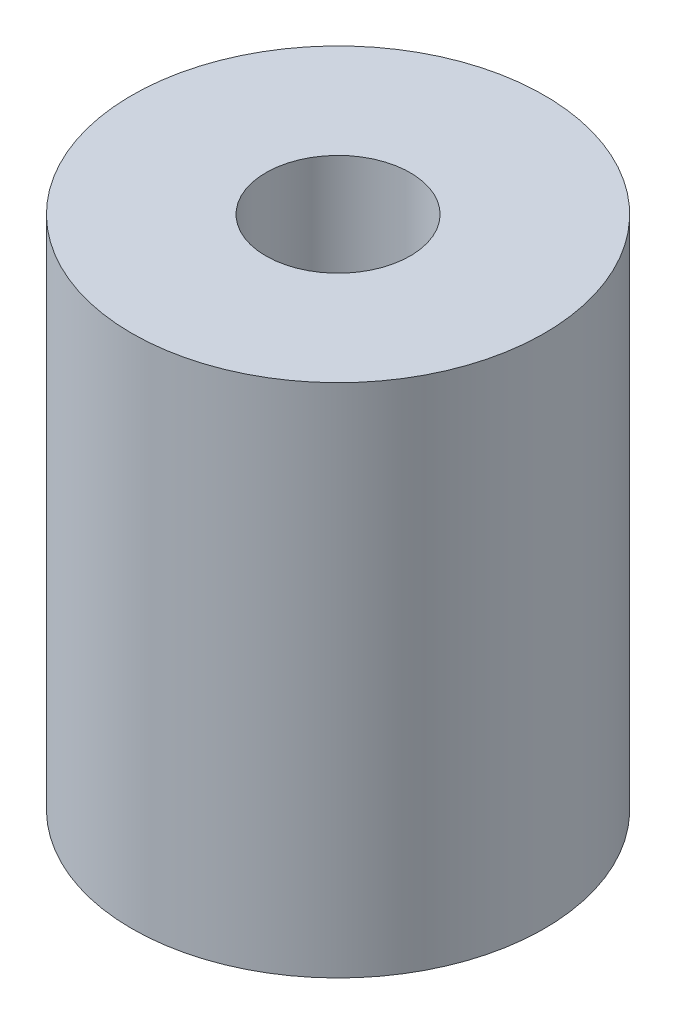
ISO-10303-21;
HEADER;
FILE_DESCRIPTION(('STEP AP214'),'2;1');
FILE_NAME('part.step','',(''),(''),'','','');
FILE_SCHEMA(('AUTOMOTIVE_DESIGN { 1 0 10303 214 1 1 1 1 }'));
ENDSEC;
DATA;
#1=APPLICATION_CONTEXT('core data for automotive mechanical design processes');
#2=APPLICATION_PROTOCOL_DEFINITION('international standard','automotive_design',2000,#1);
#3=PRODUCT_CONTEXT('',#1,'mechanical');
#4=PRODUCT('Part','Part','',(#3));
#5=PRODUCT_RELATED_PRODUCT_CATEGORY('part','',(#4));
#6=PRODUCT_DEFINITION_FORMATION('','',#4);
#7=PRODUCT_DEFINITION_CONTEXT('part definition',#1,'design');
#8=PRODUCT_DEFINITION('design','',#6,#7);
#9=PRODUCT_DEFINITION_SHAPE('','',#8);
#10=(LENGTH_UNIT() NAMED_UNIT(*) SI_UNIT(.MILLI.,.METRE.));
#11=(NAMED_UNIT(*) PLANE_ANGLE_UNIT() SI_UNIT($,.RADIAN.));
#12=(NAMED_UNIT(*) SI_UNIT($,.STERADIAN.) SOLID_ANGLE_UNIT());
#13=UNCERTAINTY_MEASURE_WITH_UNIT(LENGTH_MEASURE(1.E-05),#10,'distance_accuracy_value','');
#14=(GEOMETRIC_REPRESENTATION_CONTEXT(3) GLOBAL_UNCERTAINTY_ASSIGNED_CONTEXT((#13)) GLOBAL_UNIT_ASSIGNED_CONTEXT((#10,
#11,#12)) REPRESENTATION_CONTEXT('',''));
#15=CARTESIAN_POINT('',(0.,0.,0.));
#16=DIRECTION('',(0.,0.,1.));
#17=DIRECTION('',(1.,0.,0.));
#18=AXIS2_PLACEMENT_3D('',#15,#16,#17);
#19=CARTESIAN_POINT('',(0.,12.7,0.));
#20=DIRECTION('',(0.,1.,0.));
#21=DIRECTION('',(0.,0.,1.));
#22=AXIS2_PLACEMENT_3D('',#19,#20,#21);
#23=PLANE('',#22);
#24=CARTESIAN_POINT('',(0.,12.7,0.));
#25=DIRECTION('',(0.,1.,0.));
#26=DIRECTION('',(0.,0.,1.));
#27=AXIS2_PLACEMENT_3D('',#24,#25,#26);
#28=CIRCLE('',#27,5.08);
#29=CARTESIAN_POINT('',(0.,12.7,5.08));
#30=VERTEX_POINT('',#29);
#31=EDGE_CURVE('E11',#30,#30,#28,.T.);
#32=ORIENTED_EDGE('',*,*,#31,.T.);
#33=EDGE_LOOP('',(#32));
#34=FACE_BOUND('',#33,.T.);
#35=CARTESIAN_POINT('',(0.,12.7,0.));
#36=DIRECTION('',(0.,1.,0.));
#37=DIRECTION('',(0.,0.,1.));
#38=AXIS2_PLACEMENT_3D('',#35,#36,#37);
#39=CIRCLE('',#38,1.778);
#40=CARTESIAN_POINT('',(0.,12.7,1.778));
#41=VERTEX_POINT('',#40);
#42=EDGE_CURVE('E58',#41,#41,#39,.T.);
#43=ORIENTED_EDGE('',*,*,#42,.F.);
#44=EDGE_LOOP('',(#43));
#45=FACE_BOUND('',#44,.T.);
#46=ADVANCED_FACE('F47',(#34,#45),#23,.T.);
#47=CARTESIAN_POINT('',(0.,0.,0.));
#48=DIRECTION('',(0.,1.,0.));
#49=DIRECTION('',(0.,0.,1.));
#50=AXIS2_PLACEMENT_3D('',#47,#48,#49);
#51=PLANE('',#50);
#52=CARTESIAN_POINT('',(0.,0.,0.));
#53=DIRECTION('',(0.,1.,0.));
#54=DIRECTION('',(0.,0.,1.));
#55=AXIS2_PLACEMENT_3D('',#52,#53,#54);
#56=CIRCLE('',#55,5.08);
#57=CARTESIAN_POINT('',(0.,0.,5.08));
#58=VERTEX_POINT('',#57);
#59=EDGE_CURVE('E51',#58,#58,#56,.T.);
#60=ORIENTED_EDGE('',*,*,#59,.F.);
#61=EDGE_LOOP('',(#60));
#62=FACE_BOUND('',#61,.T.);
#63=CARTESIAN_POINT('',(0.,0.,0.));
#64=DIRECTION('',(0.,1.,0.));
#65=DIRECTION('',(0.,0.,1.));
#66=AXIS2_PLACEMENT_3D('',#63,#64,#65);
#67=CIRCLE('',#66,1.778);
#68=CARTESIAN_POINT('',(0.,0.,1.778));
#69=VERTEX_POINT('',#68);
#70=EDGE_CURVE('E60',#69,#69,#67,.T.);
#71=ORIENTED_EDGE('',*,*,#70,.T.);
#72=EDGE_LOOP('',(#71));
#73=FACE_BOUND('',#72,.T.);
#74=ADVANCED_FACE('F70',(#62,#73),#51,.F.);
#75=CARTESIAN_POINT('',(0.,12.7,0.));
#76=DIRECTION('',(0.,-1.,0.));
#77=DIRECTION('',(0.,0.,-1.));
#78=AXIS2_PLACEMENT_3D('',#75,#76,#77);
#79=CYLINDRICAL_SURFACE('',#78,5.08);
#80=ORIENTED_EDGE('',*,*,#31,.F.);
#81=EDGE_LOOP('',(#80));
#82=FACE_BOUND('',#81,.T.);
#83=ORIENTED_EDGE('',*,*,#59,.T.);
#84=EDGE_LOOP('',(#83));
#85=FACE_BOUND('',#84,.T.);
#86=ADVANCED_FACE('F49',(#82,#85),#79,.T.);
#87=CARTESIAN_POINT('',(0.,12.7,0.));
#88=DIRECTION('',(0.,-1.,0.));
#89=DIRECTION('',(0.,0.,-1.));
#90=AXIS2_PLACEMENT_3D('',#87,#88,#89);
#91=CYLINDRICAL_SURFACE('',#90,1.778);
#92=ORIENTED_EDGE('',*,*,#42,.T.);
#93=EDGE_LOOP('',(#92));
#94=FACE_BOUND('',#93,.T.);
#95=ORIENTED_EDGE('',*,*,#70,.F.);
#96=EDGE_LOOP('',(#95));
#97=FACE_BOUND('',#96,.T.);
#98=ADVANCED_FACE('F66',(#94,#97),#91,.F.);
#99=CLOSED_SHELL('',(#46,#74,#86,#98));
#100=MANIFOLD_SOLID_BREP('B2',#99);
#101=ADVANCED_BREP_SHAPE_REPRESENTATION('',(#18,#100),#14);
#102=SHAPE_DEFINITION_REPRESENTATION(#9,#101);
ENDSEC;
END-ISO-10303-21;
